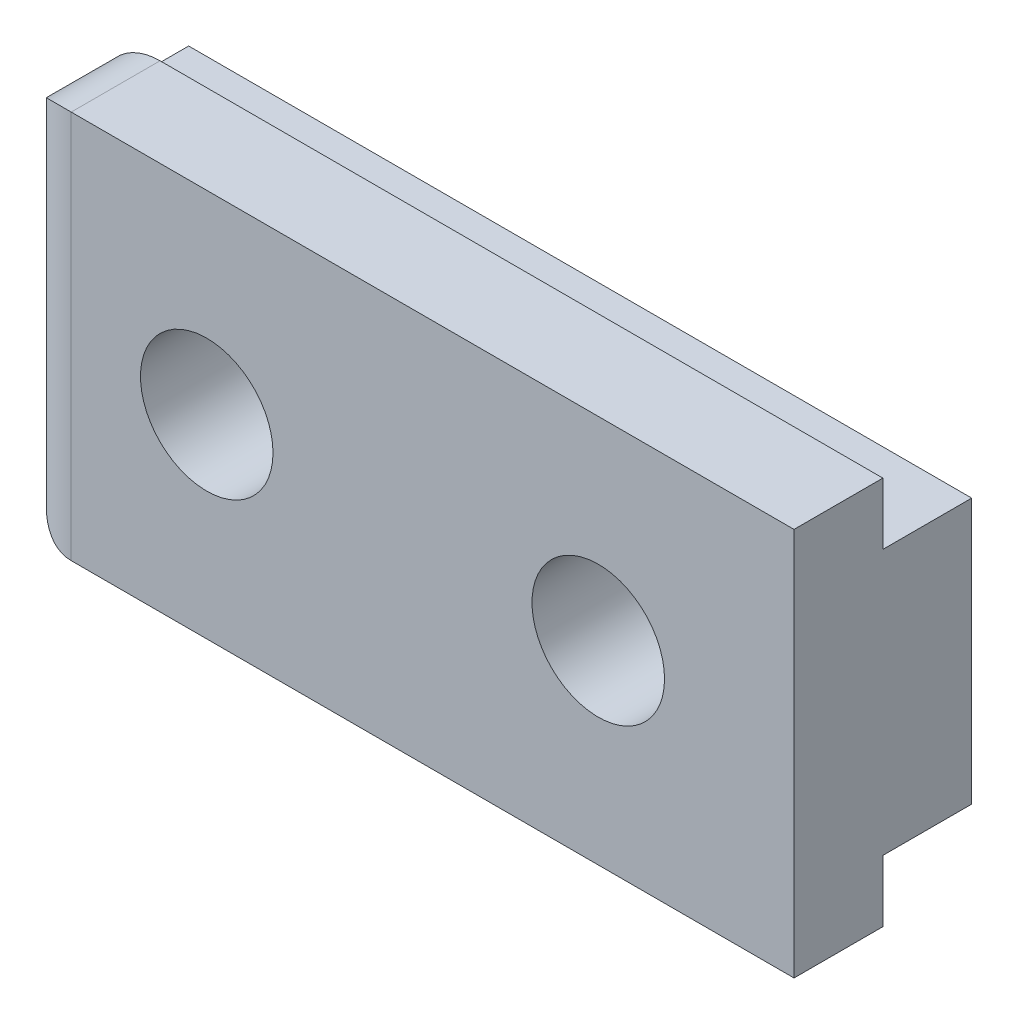
ISO-10303-21;
HEADER;
FILE_DESCRIPTION(('STEP AP214'),'2;1');
FILE_NAME('part.step','',(''),(''),'','','');
FILE_SCHEMA(('AUTOMOTIVE_DESIGN { 1 0 10303 214 1 1 1 1 }'));
ENDSEC;
DATA;
#1=APPLICATION_CONTEXT('core data for automotive mechanical design processes');
#2=APPLICATION_PROTOCOL_DEFINITION('international standard','automotive_design',2000,#1);
#3=PRODUCT_CONTEXT('',#1,'mechanical');
#4=PRODUCT('Part','Part','',(#3));
#5=PRODUCT_RELATED_PRODUCT_CATEGORY('part','',(#4));
#6=PRODUCT_DEFINITION_FORMATION('','',#4);
#7=PRODUCT_DEFINITION_CONTEXT('part definition',#1,'design');
#8=PRODUCT_DEFINITION('design','',#6,#7);
#9=PRODUCT_DEFINITION_SHAPE('','',#8);
#10=(LENGTH_UNIT() NAMED_UNIT(*) SI_UNIT(.MILLI.,.METRE.));
#11=(NAMED_UNIT(*) PLANE_ANGLE_UNIT() SI_UNIT($,.RADIAN.));
#12=(NAMED_UNIT(*) SI_UNIT($,.STERADIAN.) SOLID_ANGLE_UNIT());
#13=UNCERTAINTY_MEASURE_WITH_UNIT(LENGTH_MEASURE(1.E-05),#10,'distance_accuracy_value','');
#14=(GEOMETRIC_REPRESENTATION_CONTEXT(3) GLOBAL_UNCERTAINTY_ASSIGNED_CONTEXT((#13)) GLOBAL_UNIT_ASSIGNED_CONTEXT((#10,
#11,#12)) REPRESENTATION_CONTEXT('',''));
#15=CARTESIAN_POINT('',(0.,0.,0.));
#16=DIRECTION('',(0.,0.,1.));
#17=DIRECTION('',(1.,0.,0.));
#18=AXIS2_PLACEMENT_3D('',#15,#16,#17);
#19=CARTESIAN_POINT('',(0.,0.,0.));
#20=DIRECTION('',(0.,0.,-1.));
#21=DIRECTION('',(-1.,0.,0.));
#22=AXIS2_PLACEMENT_3D('',#19,#20,#21);
#23=PLANE('',#22);
#24=CARTESIAN_POINT('',(6.5,0.,0.));
#25=DIRECTION('',(0.,0.,-1.));
#26=DIRECTION('',(-1.,0.,0.));
#27=AXIS2_PLACEMENT_3D('',#24,#25,#26);
#28=CIRCLE('',#27,1.2);
#29=CARTESIAN_POINT('',(5.3,0.,0.));
#30=VERTEX_POINT('',#29);
#31=EDGE_CURVE('E215',#30,#30,#28,.F.);
#32=ORIENTED_EDGE('',*,*,#31,.T.);
#33=EDGE_LOOP('',(#32));
#34=FACE_BOUND('',#33,.T.);
#35=DIRECTION('',(0.,-1.,0.));
#36=VECTOR('',#35,1.);
#37=CARTESIAN_POINT('',(-13.,6.45,0.));
#38=LINE('',#37,#36);
#39=CARTESIAN_POINT('',(-13.,4.39999999999999,0.));
#40=VERTEX_POINT('',#39);
#41=CARTESIAN_POINT('',(-13.,-4.4,0.));
#42=VERTEX_POINT('',#41);
#43=EDGE_CURVE('E141',#40,#42,#38,.T.);
#44=ORIENTED_EDGE('',*,*,#43,.F.);
#45=DIRECTION('',(1.,0.,0.));
#46=VECTOR('',#45,1.);
#47=CARTESIAN_POINT('',(-13.,4.39999999999999,0.));
#48=LINE('',#47,#46);
#49=CARTESIAN_POINT('',(13.,4.4,0.));
#50=VERTEX_POINT('',#49);
#51=EDGE_CURVE('E133',#40,#50,#48,.T.);
#52=ORIENTED_EDGE('',*,*,#51,.T.);
#53=DIRECTION('',(0.,1.,0.));
#54=VECTOR('',#53,1.);
#55=CARTESIAN_POINT('',(13.,6.45,0.));
#56=LINE('',#55,#54);
#57=CARTESIAN_POINT('',(13.,-4.4,0.));
#58=VERTEX_POINT('',#57);
#59=EDGE_CURVE('E167',#58,#50,#56,.T.);
#60=ORIENTED_EDGE('',*,*,#59,.F.);
#61=DIRECTION('',(1.,0.,0.));
#62=VECTOR('',#61,1.);
#63=CARTESIAN_POINT('',(-13.,-4.4,0.));
#64=LINE('',#63,#62);
#65=EDGE_CURVE('E146',#42,#58,#64,.T.);
#66=ORIENTED_EDGE('',*,*,#65,.F.);
#67=EDGE_LOOP('',(#44,#52,#60,#66));
#68=FACE_BOUND('',#67,.T.);
#69=CARTESIAN_POINT('',(-6.5,0.,0.));
#70=DIRECTION('',(0.,0.,-1.));
#71=DIRECTION('',(-1.,0.,0.));
#72=AXIS2_PLACEMENT_3D('',#69,#70,#71);
#73=CIRCLE('',#72,1.2);
#74=CARTESIAN_POINT('',(-7.7,0.,0.));
#75=VERTEX_POINT('',#74);
#76=EDGE_CURVE('E201',#75,#75,#73,.F.);
#77=ORIENTED_EDGE('',*,*,#76,.T.);
#78=EDGE_LOOP('',(#77));
#79=FACE_BOUND('',#78,.T.);
#80=ADVANCED_FACE('F37',(#34,#68,#79),#23,.T.);
#81=CARTESIAN_POINT('',(-13.,6.45,5.9));
#82=DIRECTION('',(1.,0.,0.));
#83=DIRECTION('',(0.,1.,0.));
#84=AXIS2_PLACEMENT_3D('',#81,#82,#83);
#85=PLANE('',#84);
#86=DIRECTION('',(0.,-1.,0.));
#87=VECTOR('',#86,1.);
#88=CARTESIAN_POINT('',(-13.,6.45,3.9));
#89=LINE('',#88,#87);
#90=CARTESIAN_POINT('',(-13.,-4.45,3.9));
#91=VERTEX_POINT('',#90);
#92=CARTESIAN_POINT('',(-13.,4.45,3.9));
#93=VERTEX_POINT('',#92);
#94=EDGE_CURVE('E182',#91,#93,#89,.F.);
#95=ORIENTED_EDGE('',*,*,#94,.T.);
#96=DIRECTION('',(0.,0.,-1.));
#97=VECTOR('',#96,1.);
#98=CARTESIAN_POINT('',(-13.,4.45,5.9));
#99=LINE('',#98,#97);
#100=CARTESIAN_POINT('',(-13.,4.45,2.95));
#101=VERTEX_POINT('',#100);
#102=EDGE_CURVE('E123',#93,#101,#99,.T.);
#103=ORIENTED_EDGE('',*,*,#102,.T.);
#104=DIRECTION('',(0.,-1.,0.));
#105=VECTOR('',#104,1.);
#106=CARTESIAN_POINT('',(-13.,0.,2.95));
#107=LINE('',#106,#105);
#108=CARTESIAN_POINT('',(-13.,4.39999999999999,2.95));
#109=VERTEX_POINT('',#108);
#110=EDGE_CURVE('E116',#101,#109,#107,.T.);
#111=ORIENTED_EDGE('',*,*,#110,.T.);
#112=DIRECTION('',(0.,0.,1.));
#113=VECTOR('',#112,1.);
#114=CARTESIAN_POINT('',(-13.,4.39999999999999,0.));
#115=LINE('',#114,#113);
#116=EDGE_CURVE('E120',#40,#109,#115,.T.);
#117=ORIENTED_EDGE('',*,*,#116,.F.);
#118=ORIENTED_EDGE('',*,*,#43,.T.);
#119=DIRECTION('',(0.,0.,1.));
#120=VECTOR('',#119,1.);
#121=CARTESIAN_POINT('',(-13.,-4.4,0.));
#122=LINE('',#121,#120);
#123=CARTESIAN_POINT('',(-13.,-4.4,2.95));
#124=VERTEX_POINT('',#123);
#125=EDGE_CURVE('E158',#42,#124,#122,.T.);
#126=ORIENTED_EDGE('',*,*,#125,.T.);
#127=DIRECTION('',(0.,1.,0.));
#128=VECTOR('',#127,1.);
#129=CARTESIAN_POINT('',(-13.,-6.45,2.95));
#130=LINE('',#129,#128);
#131=CARTESIAN_POINT('',(-13.,-4.45,2.95));
#132=VERTEX_POINT('',#131);
#133=EDGE_CURVE('E148',#132,#124,#130,.T.);
#134=ORIENTED_EDGE('',*,*,#133,.F.);
#135=DIRECTION('',(0.,0.,-1.));
#136=VECTOR('',#135,1.);
#137=CARTESIAN_POINT('',(-13.,-4.45,5.9));
#138=LINE('',#137,#136);
#139=EDGE_CURVE('E180',#132,#91,#138,.F.);
#140=ORIENTED_EDGE('',*,*,#139,.T.);
#141=EDGE_LOOP('',(#95,#103,#111,#117,#118,#126,#134,#140));
#142=FACE_BOUND('',#141,.T.);
#143=ADVANCED_FACE('F118',(#142),#85,.F.);
#144=CARTESIAN_POINT('',(13.,-6.45,5.9));
#145=DIRECTION('',(0.,1.,0.));
#146=DIRECTION('',(-1.,0.,0.));
#147=AXIS2_PLACEMENT_3D('',#144,#145,#146);
#148=PLANE('',#147);
#149=DIRECTION('',(1.,0.,0.));
#150=VECTOR('',#149,1.);
#151=CARTESIAN_POINT('',(13.,-6.45,5.9));
#152=LINE('',#151,#150);
#153=CARTESIAN_POINT('',(-11.,-6.45,5.9));
#154=VERTEX_POINT('',#153);
#155=CARTESIAN_POINT('',(13.,-6.45,5.9));
#156=VERTEX_POINT('',#155);
#157=EDGE_CURVE('E164',#154,#156,#152,.T.);
#158=ORIENTED_EDGE('',*,*,#157,.F.);
#159=DIRECTION('',(0.,0.,-1.));
#160=VECTOR('',#159,1.);
#161=CARTESIAN_POINT('',(-11.,-6.45,5.9));
#162=LINE('',#161,#160);
#163=CARTESIAN_POINT('',(-11.,-6.45,2.95));
#164=VERTEX_POINT('',#163);
#165=EDGE_CURVE('E46',#154,#164,#162,.T.);
#166=ORIENTED_EDGE('',*,*,#165,.T.);
#167=DIRECTION('',(1.,0.,0.));
#168=VECTOR('',#167,1.);
#169=CARTESIAN_POINT('',(-13.,-6.45,2.95));
#170=LINE('',#169,#168);
#171=CARTESIAN_POINT('',(13.,-6.45,2.95));
#172=VERTEX_POINT('',#171);
#173=EDGE_CURVE('E151',#164,#172,#170,.T.);
#174=ORIENTED_EDGE('',*,*,#173,.T.);
#175=DIRECTION('',(0.,0.,-1.));
#176=VECTOR('',#175,1.);
#177=CARTESIAN_POINT('',(13.,-6.45,5.9));
#178=LINE('',#177,#176);
#179=EDGE_CURVE('E177',#156,#172,#178,.T.);
#180=ORIENTED_EDGE('',*,*,#179,.F.);
#181=EDGE_LOOP('',(#158,#166,#174,#180));
#182=FACE_BOUND('',#181,.T.);
#183=ADVANCED_FACE('F250',(#182),#148,.F.);
#184=CARTESIAN_POINT('',(13.,6.45,5.9));
#185=DIRECTION('',(-1.,0.,0.));
#186=DIRECTION('',(0.,0.,1.));
#187=AXIS2_PLACEMENT_3D('',#184,#185,#186);
#188=PLANE('',#187);
#189=DIRECTION('',(0.,0.,1.));
#190=VECTOR('',#189,1.);
#191=CARTESIAN_POINT('',(13.,4.4,0.));
#192=LINE('',#191,#190);
#193=CARTESIAN_POINT('',(13.,4.4,2.95));
#194=VERTEX_POINT('',#193);
#195=EDGE_CURVE('E126',#50,#194,#192,.T.);
#196=ORIENTED_EDGE('',*,*,#195,.T.);
#197=DIRECTION('',(0.,-1.,0.));
#198=VECTOR('',#197,1.);
#199=CARTESIAN_POINT('',(13.,0.,2.95));
#200=LINE('',#199,#198);
#201=CARTESIAN_POINT('',(13.,6.45,2.95));
#202=VERTEX_POINT('',#201);
#203=EDGE_CURVE('E138',#202,#194,#200,.T.);
#204=ORIENTED_EDGE('',*,*,#203,.F.);
#205=DIRECTION('',(0.,0.,-1.));
#206=VECTOR('',#205,1.);
#207=CARTESIAN_POINT('',(13.,6.45,5.9));
#208=LINE('',#207,#206);
#209=CARTESIAN_POINT('',(13.,6.45,5.9));
#210=VERTEX_POINT('',#209);
#211=EDGE_CURVE('E171',#210,#202,#208,.T.);
#212=ORIENTED_EDGE('',*,*,#211,.F.);
#213=DIRECTION('',(0.,1.,0.));
#214=VECTOR('',#213,1.);
#215=CARTESIAN_POINT('',(13.,6.45,5.9));
#216=LINE('',#215,#214);
#217=EDGE_CURVE('E166',#156,#210,#216,.T.);
#218=ORIENTED_EDGE('',*,*,#217,.F.);
#219=ORIENTED_EDGE('',*,*,#179,.T.);
#220=DIRECTION('',(0.,1.,0.));
#221=VECTOR('',#220,1.);
#222=CARTESIAN_POINT('',(13.,-6.45,2.95));
#223=LINE('',#222,#221);
#224=CARTESIAN_POINT('',(13.,-4.4,2.95));
#225=VERTEX_POINT('',#224);
#226=EDGE_CURVE('E154',#172,#225,#223,.T.);
#227=ORIENTED_EDGE('',*,*,#226,.T.);
#228=DIRECTION('',(0.,0.,1.));
#229=VECTOR('',#228,1.);
#230=CARTESIAN_POINT('',(13.,-4.4,0.));
#231=LINE('',#230,#229);
#232=EDGE_CURVE('E157',#58,#225,#231,.T.);
#233=ORIENTED_EDGE('',*,*,#232,.F.);
#234=ORIENTED_EDGE('',*,*,#59,.T.);
#235=EDGE_LOOP('',(#196,#204,#212,#218,#219,#227,#233,#234));
#236=FACE_BOUND('',#235,.T.);
#237=ADVANCED_FACE('F224',(#236),#188,.F.);
#238=CARTESIAN_POINT('',(13.,6.45,5.9));
#239=DIRECTION('',(0.,-1.,0.));
#240=DIRECTION('',(1.,0.,0.));
#241=AXIS2_PLACEMENT_3D('',#238,#239,#240);
#242=PLANE('',#241);
#243=DIRECTION('',(1.,0.,0.));
#244=VECTOR('',#243,1.);
#245=CARTESIAN_POINT('',(-13.,6.45,2.95));
#246=LINE('',#245,#244);
#247=CARTESIAN_POINT('',(-11.,6.45,2.95));
#248=VERTEX_POINT('',#247);
#249=EDGE_CURVE('E134',#248,#202,#246,.T.);
#250=ORIENTED_EDGE('',*,*,#249,.F.);
#251=DIRECTION('',(0.,0.,-1.));
#252=VECTOR('',#251,1.);
#253=CARTESIAN_POINT('',(-11.,6.45,5.9));
#254=LINE('',#253,#252);
#255=CARTESIAN_POINT('',(-11.,6.45,5.9));
#256=VERTEX_POINT('',#255);
#257=EDGE_CURVE('E187',#248,#256,#254,.F.);
#258=ORIENTED_EDGE('',*,*,#257,.T.);
#259=DIRECTION('',(-1.,0.,0.));
#260=VECTOR('',#259,1.);
#261=CARTESIAN_POINT('',(13.,6.45,5.9));
#262=LINE('',#261,#260);
#263=EDGE_CURVE('E169',#210,#256,#262,.T.);
#264=ORIENTED_EDGE('',*,*,#263,.F.);
#265=ORIENTED_EDGE('',*,*,#211,.T.);
#266=EDGE_LOOP('',(#250,#258,#264,#265));
#267=FACE_BOUND('',#266,.T.);
#268=ADVANCED_FACE('F245',(#267),#242,.F.);
#269=CARTESIAN_POINT('',(0.,0.,5.9));
#270=DIRECTION('',(0.,0.,-1.));
#271=DIRECTION('',(-1.,0.,0.));
#272=AXIS2_PLACEMENT_3D('',#269,#270,#271);
#273=PLANE('',#272);
#274=CARTESIAN_POINT('',(-6.5,0.,5.9));
#275=DIRECTION('',(0.,0.,1.));
#276=DIRECTION('',(1.,0.,0.));
#277=AXIS2_PLACEMENT_3D('',#274,#275,#276);
#278=CIRCLE('',#277,2.2);
#279=CARTESIAN_POINT('',(-4.3,0.,5.9));
#280=VERTEX_POINT('',#279);
#281=EDGE_CURVE('E196',#280,#280,#278,.T.);
#282=ORIENTED_EDGE('',*,*,#281,.F.);
#283=EDGE_LOOP('',(#282));
#284=FACE_BOUND('',#283,.T.);
#285=CARTESIAN_POINT('',(6.5,0.,5.9));
#286=DIRECTION('',(0.,0.,1.));
#287=DIRECTION('',(1.,0.,0.));
#288=AXIS2_PLACEMENT_3D('',#285,#286,#287);
#289=CIRCLE('',#288,2.2);
#290=CARTESIAN_POINT('',(8.7,0.,5.9));
#291=VERTEX_POINT('',#290);
#292=EDGE_CURVE('E218',#291,#291,#289,.T.);
#293=ORIENTED_EDGE('',*,*,#292,.F.);
#294=EDGE_LOOP('',(#293));
#295=FACE_BOUND('',#294,.T.);
#296=ORIENTED_EDGE('',*,*,#263,.T.);
#297=DIRECTION('',(0.,-1.,0.));
#298=VECTOR('',#297,1.);
#299=CARTESIAN_POINT('',(-11.,0.,5.9));
#300=LINE('',#299,#298);
#301=EDGE_CURVE('E61',#256,#154,#300,.T.);
#302=ORIENTED_EDGE('',*,*,#301,.T.);
#303=ORIENTED_EDGE('',*,*,#157,.T.);
#304=ORIENTED_EDGE('',*,*,#217,.T.);
#305=EDGE_LOOP('',(#296,#302,#303,#304));
#306=FACE_BOUND('',#305,.T.);
#307=ADVANCED_FACE('F249',(#284,#295,#306),#273,.F.);
#308=CARTESIAN_POINT('',(-13.,-6.45,2.95));
#309=DIRECTION('',(0.,0.,-1.));
#310=DIRECTION('',(-1.,0.,0.));
#311=AXIS2_PLACEMENT_3D('',#308,#309,#310);
#312=PLANE('',#311);
#313=ORIENTED_EDGE('',*,*,#173,.F.);
#314=CARTESIAN_POINT('',(-11.,-4.45,2.95));
#315=DIRECTION('',(0.,0.,-1.));
#316=DIRECTION('',(-1.,0.,0.));
#317=AXIS2_PLACEMENT_3D('',#314,#315,#316);
#318=CIRCLE('',#317,2.);
#319=EDGE_CURVE('E11',#164,#132,#318,.T.);
#320=ORIENTED_EDGE('',*,*,#319,.T.);
#321=ORIENTED_EDGE('',*,*,#133,.T.);
#322=DIRECTION('',(1.,0.,0.));
#323=VECTOR('',#322,1.);
#324=CARTESIAN_POINT('',(-13.,-4.4,2.95));
#325=LINE('',#324,#323);
#326=EDGE_CURVE('E149',#124,#225,#325,.T.);
#327=ORIENTED_EDGE('',*,*,#326,.T.);
#328=ORIENTED_EDGE('',*,*,#226,.F.);
#329=EDGE_LOOP('',(#313,#320,#321,#327,#328));
#330=FACE_BOUND('',#329,.T.);
#331=ADVANCED_FACE('F238',(#330),#312,.T.);
#332=CARTESIAN_POINT('',(-13.,-4.4,0.));
#333=DIRECTION('',(0.,1.,0.));
#334=DIRECTION('',(-1.,0.,0.));
#335=AXIS2_PLACEMENT_3D('',#332,#333,#334);
#336=PLANE('',#335);
#337=ORIENTED_EDGE('',*,*,#232,.T.);
#338=ORIENTED_EDGE('',*,*,#326,.F.);
#339=ORIENTED_EDGE('',*,*,#125,.F.);
#340=ORIENTED_EDGE('',*,*,#65,.T.);
#341=EDGE_LOOP('',(#337,#338,#339,#340));
#342=FACE_BOUND('',#341,.T.);
#343=ADVANCED_FACE('F235',(#342),#336,.F.);
#344=CARTESIAN_POINT('',(-13.,4.39999999999999,0.));
#345=DIRECTION('',(0.,1.,0.));
#346=DIRECTION('',(-1.,0.,0.));
#347=AXIS2_PLACEMENT_3D('',#344,#345,#346);
#348=PLANE('',#347);
#349=ORIENTED_EDGE('',*,*,#195,.F.);
#350=ORIENTED_EDGE('',*,*,#51,.F.);
#351=ORIENTED_EDGE('',*,*,#116,.T.);
#352=DIRECTION('',(1.,0.,0.));
#353=VECTOR('',#352,1.);
#354=CARTESIAN_POINT('',(-13.,4.39999999999999,2.95));
#355=LINE('',#354,#353);
#356=EDGE_CURVE('E130',#109,#194,#355,.T.);
#357=ORIENTED_EDGE('',*,*,#356,.T.);
#358=EDGE_LOOP('',(#349,#350,#351,#357));
#359=FACE_BOUND('',#358,.T.);
#360=ADVANCED_FACE('F129',(#359),#348,.T.);
#361=CARTESIAN_POINT('',(-13.,0.,2.95));
#362=DIRECTION('',(0.,0.,1.));
#363=DIRECTION('',(0.,-1.,0.));
#364=AXIS2_PLACEMENT_3D('',#361,#362,#363);
#365=PLANE('',#364);
#366=ORIENTED_EDGE('',*,*,#110,.F.);
#367=CARTESIAN_POINT('',(-11.,4.45,2.95));
#368=DIRECTION('',(0.,0.,1.));
#369=DIRECTION('',(0.,-1.,0.));
#370=AXIS2_PLACEMENT_3D('',#367,#368,#369);
#371=CIRCLE('',#370,2.);
#372=EDGE_CURVE('E185',#101,#248,#371,.F.);
#373=ORIENTED_EDGE('',*,*,#372,.T.);
#374=ORIENTED_EDGE('',*,*,#249,.T.);
#375=ORIENTED_EDGE('',*,*,#203,.T.);
#376=ORIENTED_EDGE('',*,*,#356,.F.);
#377=EDGE_LOOP('',(#366,#373,#374,#375,#376));
#378=FACE_BOUND('',#377,.T.);
#379=ADVANCED_FACE('F136',(#378),#365,.F.);
#380=CARTESIAN_POINT('',(6.5,0.,5.9));
#381=DIRECTION('',(0.,0.,1.));
#382=DIRECTION('',(1.,0.,0.));
#383=AXIS2_PLACEMENT_3D('',#380,#381,#382);
#384=CYLINDRICAL_SURFACE('',#383,1.2);
#385=ORIENTED_EDGE('',*,*,#31,.F.);
#386=EDGE_LOOP('',(#385));
#387=FACE_BOUND('',#386,.T.);
#388=CARTESIAN_POINT('',(6.5,0.,0.4));
#389=DIRECTION('',(0.,0.,1.));
#390=DIRECTION('',(1.,0.,0.));
#391=AXIS2_PLACEMENT_3D('',#388,#389,#390);
#392=CIRCLE('',#391,1.2);
#393=CARTESIAN_POINT('',(7.7,0.,0.4));
#394=VERTEX_POINT('',#393);
#395=EDGE_CURVE('E212',#394,#394,#392,.T.);
#396=ORIENTED_EDGE('',*,*,#395,.T.);
#397=EDGE_LOOP('',(#396));
#398=FACE_BOUND('',#397,.T.);
#399=ADVANCED_FACE('F291',(#387,#398),#384,.F.);
#400=CARTESIAN_POINT('',(6.5,0.,1.4));
#401=DIRECTION('',(0.,0.,1.));
#402=DIRECTION('',(1.,0.,0.));
#403=AXIS2_PLACEMENT_3D('',#400,#401,#402);
#404=CONICAL_SURFACE('',#403,2.2,0.785398163397448);
#405=ORIENTED_EDGE('',*,*,#395,.F.);
#406=EDGE_LOOP('',(#405));
#407=FACE_BOUND('',#406,.T.);
#408=CARTESIAN_POINT('',(6.5,0.,1.4));
#409=DIRECTION('',(0.,0.,1.));
#410=DIRECTION('',(1.,0.,0.));
#411=AXIS2_PLACEMENT_3D('',#408,#409,#410);
#412=CIRCLE('',#411,2.2);
#413=CARTESIAN_POINT('',(8.7,0.,1.4));
#414=VERTEX_POINT('',#413);
#415=EDGE_CURVE('E153',#414,#414,#412,.T.);
#416=ORIENTED_EDGE('',*,*,#415,.T.);
#417=EDGE_LOOP('',(#416));
#418=FACE_BOUND('',#417,.T.);
#419=ADVANCED_FACE('F281',(#407,#418),#404,.F.);
#420=CARTESIAN_POINT('',(6.5,0.,5.9));
#421=DIRECTION('',(0.,0.,1.));
#422=DIRECTION('',(1.,0.,0.));
#423=AXIS2_PLACEMENT_3D('',#420,#421,#422);
#424=CYLINDRICAL_SURFACE('',#423,2.2);
#425=ORIENTED_EDGE('',*,*,#415,.F.);
#426=EDGE_LOOP('',(#425));
#427=FACE_BOUND('',#426,.T.);
#428=ORIENTED_EDGE('',*,*,#292,.T.);
#429=EDGE_LOOP('',(#428));
#430=FACE_BOUND('',#429,.T.);
#431=ADVANCED_FACE('F278',(#427,#430),#424,.F.);
#432=CARTESIAN_POINT('',(-6.5,0.,5.9));
#433=DIRECTION('',(0.,0.,1.));
#434=DIRECTION('',(1.,0.,0.));
#435=AXIS2_PLACEMENT_3D('',#432,#433,#434);
#436=CYLINDRICAL_SURFACE('',#435,1.2);
#437=ORIENTED_EDGE('',*,*,#76,.F.);
#438=EDGE_LOOP('',(#437));
#439=FACE_BOUND('',#438,.T.);
#440=CARTESIAN_POINT('',(-6.5,0.,0.4));
#441=DIRECTION('',(0.,0.,1.));
#442=DIRECTION('',(1.,0.,0.));
#443=AXIS2_PLACEMENT_3D('',#440,#441,#442);
#444=CIRCLE('',#443,1.2);
#445=CARTESIAN_POINT('',(-5.3,0.,0.4));
#446=VERTEX_POINT('',#445);
#447=EDGE_CURVE('E206',#446,#446,#444,.T.);
#448=ORIENTED_EDGE('',*,*,#447,.T.);
#449=EDGE_LOOP('',(#448));
#450=FACE_BOUND('',#449,.T.);
#451=ADVANCED_FACE('F280',(#439,#450),#436,.F.);
#452=CARTESIAN_POINT('',(-6.5,0.,1.4));
#453=DIRECTION('',(0.,0.,1.));
#454=DIRECTION('',(1.,0.,0.));
#455=AXIS2_PLACEMENT_3D('',#452,#453,#454);
#456=CONICAL_SURFACE('',#455,2.2,0.785398163397449);
#457=ORIENTED_EDGE('',*,*,#447,.F.);
#458=EDGE_LOOP('',(#457));
#459=FACE_BOUND('',#458,.T.);
#460=CARTESIAN_POINT('',(-6.5,0.,1.4));
#461=DIRECTION('',(0.,0.,1.));
#462=DIRECTION('',(1.,0.,0.));
#463=AXIS2_PLACEMENT_3D('',#460,#461,#462);
#464=CIRCLE('',#463,2.2);
#465=CARTESIAN_POINT('',(-4.3,0.,1.4));
#466=VERTEX_POINT('',#465);
#467=EDGE_CURVE('E209',#466,#466,#464,.T.);
#468=ORIENTED_EDGE('',*,*,#467,.T.);
#469=EDGE_LOOP('',(#468));
#470=FACE_BOUND('',#469,.T.);
#471=ADVANCED_FACE('F288',(#459,#470),#456,.F.);
#472=CARTESIAN_POINT('',(-6.5,0.,5.9));
#473=DIRECTION('',(0.,0.,1.));
#474=DIRECTION('',(1.,0.,0.));
#475=AXIS2_PLACEMENT_3D('',#472,#473,#474);
#476=CYLINDRICAL_SURFACE('',#475,2.2);
#477=ORIENTED_EDGE('',*,*,#467,.F.);
#478=EDGE_LOOP('',(#477));
#479=FACE_BOUND('',#478,.T.);
#480=ORIENTED_EDGE('',*,*,#281,.T.);
#481=EDGE_LOOP('',(#480));
#482=FACE_BOUND('',#481,.T.);
#483=ADVANCED_FACE('F348',(#479,#482),#476,.F.);
#484=CARTESIAN_POINT('',(-11.,-4.45,5.9));
#485=DIRECTION('',(0.,0.,-1.));
#486=DIRECTION('',(-1.,0.,0.));
#487=AXIS2_PLACEMENT_3D('',#484,#485,#486);
#488=CYLINDRICAL_SURFACE('',#487,2.);
#489=ORIENTED_EDGE('',*,*,#319,.F.);
#490=ORIENTED_EDGE('',*,*,#165,.F.);
#491=CARTESIAN_POINT('',(-11.,-4.45,3.9));
#492=DIRECTION('',(0.,-0.707106781186547,-0.707106781186547));
#493=DIRECTION('',(0.,0.707106781186547,-0.707106781186547));
#494=AXIS2_PLACEMENT_3D('',#491,#492,#493);
#495=ELLIPSE('',#494,2.82842712474619,2.);
#496=EDGE_CURVE('E41',#91,#154,#495,.F.);
#497=ORIENTED_EDGE('',*,*,#496,.F.);
#498=ORIENTED_EDGE('',*,*,#139,.F.);
#499=EDGE_LOOP('',(#489,#490,#497,#498));
#500=FACE_BOUND('',#499,.T.);
#501=ADVANCED_FACE('F39',(#500),#488,.T.);
#502=CARTESIAN_POINT('',(-11.,0.,3.9));
#503=DIRECTION('',(0.,-1.,0.));
#504=DIRECTION('',(1.,0.,0.));
#505=AXIS2_PLACEMENT_3D('',#502,#503,#504);
#506=CYLINDRICAL_SURFACE('',#505,2.);
#507=ORIENTED_EDGE('',*,*,#496,.T.);
#508=ORIENTED_EDGE('',*,*,#301,.F.);
#509=CARTESIAN_POINT('',(-11.,4.45,3.9));
#510=DIRECTION('',(0.,-0.707106781186547,0.707106781186547));
#511=DIRECTION('',(0.,-0.707106781186547,-0.707106781186547));
#512=AXIS2_PLACEMENT_3D('',#509,#510,#511);
#513=ELLIPSE('',#512,2.82842712474619,2.);
#514=EDGE_CURVE('E190',#93,#256,#513,.F.);
#515=ORIENTED_EDGE('',*,*,#514,.F.);
#516=ORIENTED_EDGE('',*,*,#94,.F.);
#517=EDGE_LOOP('',(#507,#508,#515,#516));
#518=FACE_BOUND('',#517,.T.);
#519=ADVANCED_FACE('F241',(#518),#506,.T.);
#520=CARTESIAN_POINT('',(-11.,4.45,5.9));
#521=DIRECTION('',(0.,0.,-1.));
#522=DIRECTION('',(-1.,0.,0.));
#523=AXIS2_PLACEMENT_3D('',#520,#521,#522);
#524=CYLINDRICAL_SURFACE('',#523,2.);
#525=ORIENTED_EDGE('',*,*,#514,.T.);
#526=ORIENTED_EDGE('',*,*,#257,.F.);
#527=ORIENTED_EDGE('',*,*,#372,.F.);
#528=ORIENTED_EDGE('',*,*,#102,.F.);
#529=EDGE_LOOP('',(#525,#526,#527,#528));
#530=FACE_BOUND('',#529,.T.);
#531=ADVANCED_FACE('F242',(#530),#524,.T.);
#532=CLOSED_SHELL('',(#80,#143,#183,#237,#268,#307,#331,#343,#360,#379,#399,#419,#431,#451,#471,
#483,#501,#519,#531));
#533=MANIFOLD_SOLID_BREP('B2',#532);
#534=ADVANCED_BREP_SHAPE_REPRESENTATION('',(#18,#533),#14);
#535=SHAPE_DEFINITION_REPRESENTATION(#9,#534);
ENDSEC;
END-ISO-10303-21;
